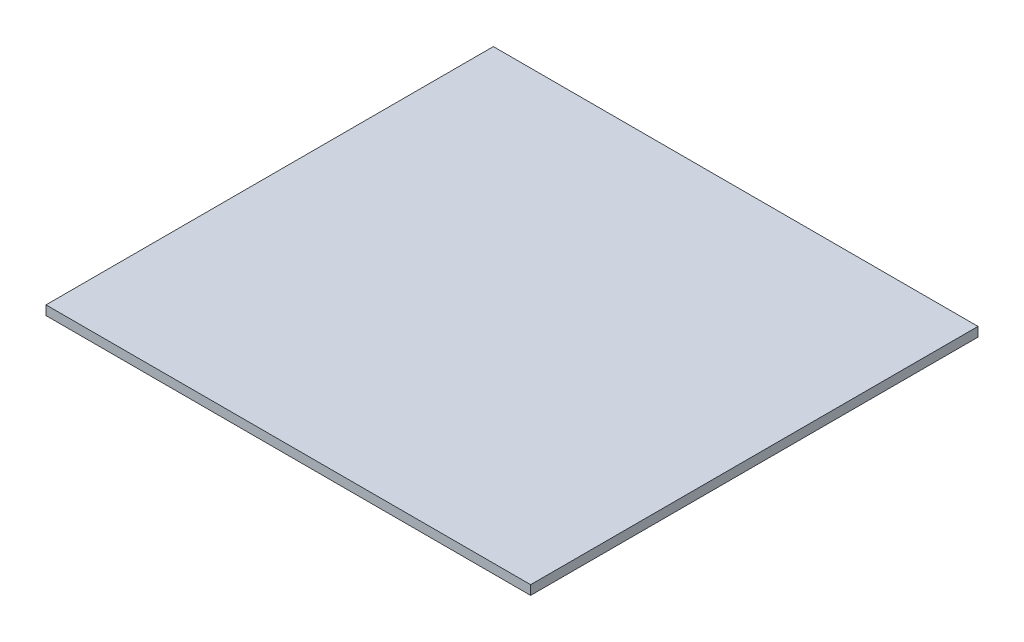
ISO-10303-21;
HEADER;
FILE_DESCRIPTION(('STEP AP214'),'2;1');
FILE_NAME('part.step','',(''),(''),'','','');
FILE_SCHEMA(('AUTOMOTIVE_DESIGN { 1 0 10303 214 1 1 1 1 }'));
ENDSEC;
DATA;
#1=APPLICATION_CONTEXT('core data for automotive mechanical design processes');
#2=APPLICATION_PROTOCOL_DEFINITION('international standard','automotive_design',2000,#1);
#3=PRODUCT_CONTEXT('',#1,'mechanical');
#4=PRODUCT('Part','Part','',(#3));
#5=PRODUCT_RELATED_PRODUCT_CATEGORY('part','',(#4));
#6=PRODUCT_DEFINITION_FORMATION('','',#4);
#7=PRODUCT_DEFINITION_CONTEXT('part definition',#1,'design');
#8=PRODUCT_DEFINITION('design','',#6,#7);
#9=PRODUCT_DEFINITION_SHAPE('','',#8);
#10=(LENGTH_UNIT() NAMED_UNIT(*) SI_UNIT(.MILLI.,.METRE.));
#11=(NAMED_UNIT(*) PLANE_ANGLE_UNIT() SI_UNIT($,.RADIAN.));
#12=(NAMED_UNIT(*) SI_UNIT($,.STERADIAN.) SOLID_ANGLE_UNIT());
#13=UNCERTAINTY_MEASURE_WITH_UNIT(LENGTH_MEASURE(1.E-05),#10,'distance_accuracy_value','');
#14=(GEOMETRIC_REPRESENTATION_CONTEXT(3) GLOBAL_UNCERTAINTY_ASSIGNED_CONTEXT((#13)) GLOBAL_UNIT_ASSIGNED_CONTEXT((#10,
#11,#12)) REPRESENTATION_CONTEXT('',''));
#15=CARTESIAN_POINT('',(0.,0.,0.));
#16=DIRECTION('',(0.,0.,1.));
#17=DIRECTION('',(1.,0.,0.));
#18=AXIS2_PLACEMENT_3D('',#15,#16,#17);
#19=CARTESIAN_POINT('',(0.,12.7,0.));
#20=DIRECTION('',(1.,0.,0.));
#21=DIRECTION('',(0.,0.,-1.));
#22=AXIS2_PLACEMENT_3D('',#19,#20,#21);
#23=PLANE('',#22);
#24=DIRECTION('',(0.,0.,1.));
#25=VECTOR('',#24,1.);
#26=CARTESIAN_POINT('',(0.,0.,0.));
#27=LINE('',#26,#25);
#28=CARTESIAN_POINT('',(0.,0.,-609.6));
#29=VERTEX_POINT('',#28);
#30=CARTESIAN_POINT('',(0.,0.,0.));
#31=VERTEX_POINT('',#30);
#32=EDGE_CURVE('E100',#29,#31,#27,.T.);
#33=ORIENTED_EDGE('',*,*,#32,.T.);
#34=DIRECTION('',(0.,-1.,0.));
#35=VECTOR('',#34,1.);
#36=CARTESIAN_POINT('',(0.,12.7,0.));
#37=LINE('',#36,#35);
#38=CARTESIAN_POINT('',(0.,12.7,0.));
#39=VERTEX_POINT('',#38);
#40=EDGE_CURVE('E11',#39,#31,#37,.T.);
#41=ORIENTED_EDGE('',*,*,#40,.F.);
#42=DIRECTION('',(0.,0.,1.));
#43=VECTOR('',#42,1.);
#44=CARTESIAN_POINT('',(0.,12.7,0.));
#45=LINE('',#44,#43);
#46=CARTESIAN_POINT('',(0.,12.7,-609.6));
#47=VERTEX_POINT('',#46);
#48=EDGE_CURVE('E88',#47,#39,#45,.T.);
#49=ORIENTED_EDGE('',*,*,#48,.F.);
#50=DIRECTION('',(0.,-1.,0.));
#51=VECTOR('',#50,1.);
#52=CARTESIAN_POINT('',(0.,12.7,-609.6));
#53=LINE('',#52,#51);
#54=EDGE_CURVE('E96',#47,#29,#53,.T.);
#55=ORIENTED_EDGE('',*,*,#54,.T.);
#56=EDGE_LOOP('',(#33,#41,#49,#55));
#57=FACE_BOUND('',#56,.T.);
#58=ADVANCED_FACE('F37',(#57),#23,.F.);
#59=CARTESIAN_POINT('',(0.,12.7,0.));
#60=DIRECTION('',(0.,0.,-1.));
#61=DIRECTION('',(-1.,0.,0.));
#62=AXIS2_PLACEMENT_3D('',#59,#60,#61);
#63=PLANE('',#62);
#64=DIRECTION('',(1.,0.,0.));
#65=VECTOR('',#64,1.);
#66=CARTESIAN_POINT('',(0.,0.,0.));
#67=LINE('',#66,#65);
#68=CARTESIAN_POINT('',(660.4,0.,0.));
#69=VERTEX_POINT('',#68);
#70=EDGE_CURVE('E92',#31,#69,#67,.T.);
#71=ORIENTED_EDGE('',*,*,#70,.T.);
#72=DIRECTION('',(0.,-1.,0.));
#73=VECTOR('',#72,1.);
#74=CARTESIAN_POINT('',(660.4,12.7,0.));
#75=LINE('',#74,#73);
#76=CARTESIAN_POINT('',(660.4,12.7,0.));
#77=VERTEX_POINT('',#76);
#78=EDGE_CURVE('E45',#77,#69,#75,.T.);
#79=ORIENTED_EDGE('',*,*,#78,.F.);
#80=DIRECTION('',(1.,0.,0.));
#81=VECTOR('',#80,1.);
#82=CARTESIAN_POINT('',(0.,12.7,0.));
#83=LINE('',#82,#81);
#84=EDGE_CURVE('E83',#39,#77,#83,.T.);
#85=ORIENTED_EDGE('',*,*,#84,.F.);
#86=ORIENTED_EDGE('',*,*,#40,.T.);
#87=EDGE_LOOP('',(#71,#79,#85,#86));
#88=FACE_BOUND('',#87,.T.);
#89=ADVANCED_FACE('F91',(#88),#63,.F.);
#90=CARTESIAN_POINT('',(660.4,12.7,0.));
#91=DIRECTION('',(-1.,0.,0.));
#92=DIRECTION('',(0.,0.,1.));
#93=AXIS2_PLACEMENT_3D('',#90,#91,#92);
#94=PLANE('',#93);
#95=DIRECTION('',(0.,0.,-1.));
#96=VECTOR('',#95,1.);
#97=CARTESIAN_POINT('',(660.4,0.,0.));
#98=LINE('',#97,#96);
#99=CARTESIAN_POINT('',(660.4,0.,-609.6));
#100=VERTEX_POINT('',#99);
#101=EDGE_CURVE('E70',#69,#100,#98,.T.);
#102=ORIENTED_EDGE('',*,*,#101,.T.);
#103=DIRECTION('',(0.,-1.,0.));
#104=VECTOR('',#103,1.);
#105=CARTESIAN_POINT('',(660.4,12.7,-609.6));
#106=LINE('',#105,#104);
#107=CARTESIAN_POINT('',(660.4,12.7,-609.6));
#108=VERTEX_POINT('',#107);
#109=EDGE_CURVE('E93',#108,#100,#106,.T.);
#110=ORIENTED_EDGE('',*,*,#109,.F.);
#111=DIRECTION('',(0.,0.,-1.));
#112=VECTOR('',#111,1.);
#113=CARTESIAN_POINT('',(660.4,12.7,0.));
#114=LINE('',#113,#112);
#115=EDGE_CURVE('E86',#77,#108,#114,.T.);
#116=ORIENTED_EDGE('',*,*,#115,.F.);
#117=ORIENTED_EDGE('',*,*,#78,.T.);
#118=EDGE_LOOP('',(#102,#110,#116,#117));
#119=FACE_BOUND('',#118,.T.);
#120=ADVANCED_FACE('F94',(#119),#94,.F.);
#121=CARTESIAN_POINT('',(0.,12.7,-609.6));
#122=DIRECTION('',(0.,0.,1.));
#123=DIRECTION('',(1.,0.,0.));
#124=AXIS2_PLACEMENT_3D('',#121,#122,#123);
#125=PLANE('',#124);
#126=DIRECTION('',(-1.,0.,0.));
#127=VECTOR('',#126,1.);
#128=CARTESIAN_POINT('',(0.,0.,-609.6));
#129=LINE('',#128,#127);
#130=EDGE_CURVE('E76',#100,#29,#129,.T.);
#131=ORIENTED_EDGE('',*,*,#130,.T.);
#132=ORIENTED_EDGE('',*,*,#54,.F.);
#133=DIRECTION('',(-1.,0.,0.));
#134=VECTOR('',#133,1.);
#135=CARTESIAN_POINT('',(0.,12.7,-609.6));
#136=LINE('',#135,#134);
#137=EDGE_CURVE('E53',#108,#47,#136,.T.);
#138=ORIENTED_EDGE('',*,*,#137,.F.);
#139=ORIENTED_EDGE('',*,*,#109,.T.);
#140=EDGE_LOOP('',(#131,#132,#138,#139));
#141=FACE_BOUND('',#140,.T.);
#142=ADVANCED_FACE('F107',(#141),#125,.F.);
#143=CARTESIAN_POINT('',(0.,12.7,0.));
#144=DIRECTION('',(0.,-1.,0.));
#145=DIRECTION('',(0.,0.,-1.));
#146=AXIS2_PLACEMENT_3D('',#143,#144,#145);
#147=PLANE('',#146);
#148=ORIENTED_EDGE('',*,*,#48,.T.);
#149=ORIENTED_EDGE('',*,*,#84,.T.);
#150=ORIENTED_EDGE('',*,*,#115,.T.);
#151=ORIENTED_EDGE('',*,*,#137,.T.);
#152=EDGE_LOOP('',(#148,#149,#150,#151));
#153=FACE_BOUND('',#152,.T.);
#154=ADVANCED_FACE('F84',(#153),#147,.F.);
#155=CARTESIAN_POINT('',(0.,0.,0.));
#156=DIRECTION('',(0.,-1.,0.));
#157=DIRECTION('',(0.,0.,-1.));
#158=AXIS2_PLACEMENT_3D('',#155,#156,#157);
#159=PLANE('',#158);
#160=ORIENTED_EDGE('',*,*,#32,.F.);
#161=ORIENTED_EDGE('',*,*,#130,.F.);
#162=ORIENTED_EDGE('',*,*,#101,.F.);
#163=ORIENTED_EDGE('',*,*,#70,.F.);
#164=EDGE_LOOP('',(#160,#161,#162,#163));
#165=FACE_BOUND('',#164,.T.);
#166=ADVANCED_FACE('F110',(#165),#159,.T.);
#167=CLOSED_SHELL('',(#58,#89,#120,#142,#154,#166));
#168=MANIFOLD_SOLID_BREP('B2',#167);
#169=ADVANCED_BREP_SHAPE_REPRESENTATION('',(#18,#168),#14);
#170=SHAPE_DEFINITION_REPRESENTATION(#9,#169);
ENDSEC;
END-ISO-10303-21;
